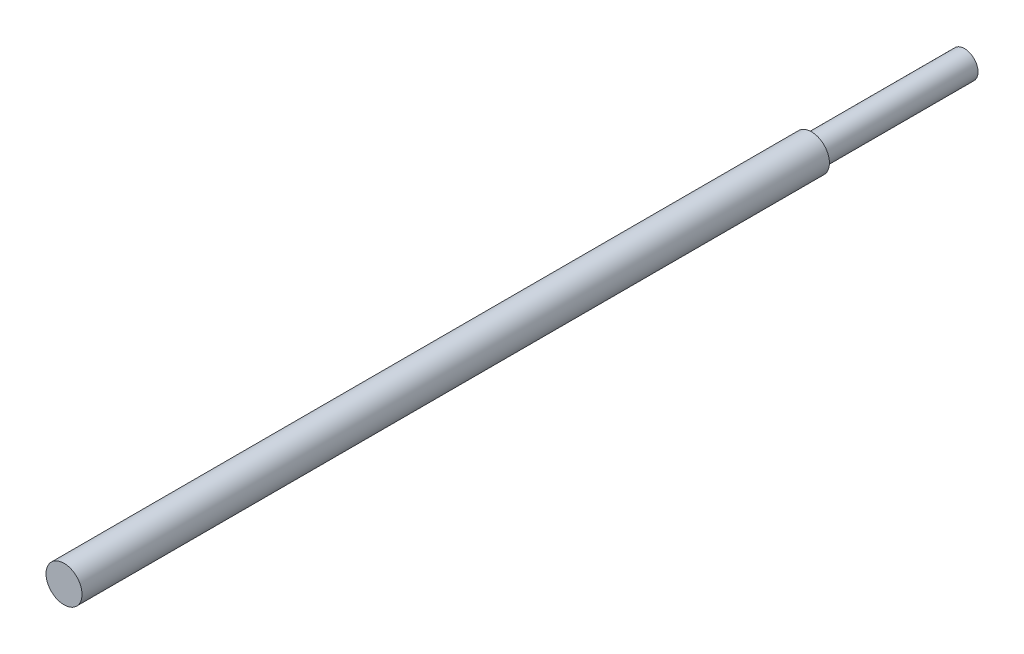
ISO-10303-21;
HEADER;
FILE_DESCRIPTION(('STEP AP214'),'2;1');
FILE_NAME('part.step','',(''),(''),'','','');
FILE_SCHEMA(('AUTOMOTIVE_DESIGN { 1 0 10303 214 1 1 1 1 }'));
ENDSEC;
DATA;
#1=APPLICATION_CONTEXT('core data for automotive mechanical design processes');
#2=APPLICATION_PROTOCOL_DEFINITION('international standard','automotive_design',2000,#1);
#3=PRODUCT_CONTEXT('',#1,'mechanical');
#4=PRODUCT('Part','Part','',(#3));
#5=PRODUCT_RELATED_PRODUCT_CATEGORY('part','',(#4));
#6=PRODUCT_DEFINITION_FORMATION('','',#4);
#7=PRODUCT_DEFINITION_CONTEXT('part definition',#1,'design');
#8=PRODUCT_DEFINITION('design','',#6,#7);
#9=PRODUCT_DEFINITION_SHAPE('','',#8);
#10=(LENGTH_UNIT() NAMED_UNIT(*) SI_UNIT(.MILLI.,.METRE.));
#11=(NAMED_UNIT(*) PLANE_ANGLE_UNIT() SI_UNIT($,.RADIAN.));
#12=(NAMED_UNIT(*) SI_UNIT($,.STERADIAN.) SOLID_ANGLE_UNIT());
#13=UNCERTAINTY_MEASURE_WITH_UNIT(LENGTH_MEASURE(1.E-05),#10,'distance_accuracy_value','');
#14=(GEOMETRIC_REPRESENTATION_CONTEXT(3) GLOBAL_UNCERTAINTY_ASSIGNED_CONTEXT((#13)) GLOBAL_UNIT_ASSIGNED_CONTEXT((#10,
#11,#12)) REPRESENTATION_CONTEXT('',''));
#15=CARTESIAN_POINT('',(0.,0.,0.));
#16=DIRECTION('',(0.,0.,1.));
#17=DIRECTION('',(1.,0.,0.));
#18=AXIS2_PLACEMENT_3D('',#15,#16,#17);
#19=CARTESIAN_POINT('',(0.,0.,400.));
#20=DIRECTION('',(0.,0.,-1.));
#21=DIRECTION('',(-1.,0.,0.));
#22=AXIS2_PLACEMENT_3D('',#19,#20,#21);
#23=CYLINDRICAL_SURFACE('',#22,8.);
#24=CARTESIAN_POINT('',(0.,0.,400.));
#25=DIRECTION('',(0.,0.,1.));
#26=DIRECTION('',(1.,0.,0.));
#27=AXIS2_PLACEMENT_3D('',#24,#25,#26);
#28=CIRCLE('',#27,8.);
#29=CARTESIAN_POINT('',(8.,0.,400.));
#30=VERTEX_POINT('',#29);
#31=EDGE_CURVE('E10',#30,#30,#28,.T.);
#32=ORIENTED_EDGE('',*,*,#31,.F.);
#33=EDGE_LOOP('',(#32));
#34=FACE_BOUND('',#33,.T.);
#35=CARTESIAN_POINT('',(0.,0.,68.));
#36=DIRECTION('',(0.,0.,-1.));
#37=DIRECTION('',(-1.,0.,0.));
#38=AXIS2_PLACEMENT_3D('',#35,#36,#37);
#39=CIRCLE('',#38,8.);
#40=CARTESIAN_POINT('',(-8.,0.,68.));
#41=VERTEX_POINT('',#40);
#42=EDGE_CURVE('E35',#41,#41,#39,.T.);
#43=ORIENTED_EDGE('',*,*,#42,.F.);
#44=EDGE_LOOP('',(#43));
#45=FACE_BOUND('',#44,.T.);
#46=ADVANCED_FACE('F32',(#34,#45),#23,.T.);
#47=CARTESIAN_POINT('',(0.,0.,400.));
#48=DIRECTION('',(0.,0.,1.));
#49=DIRECTION('',(1.,0.,0.));
#50=AXIS2_PLACEMENT_3D('',#47,#48,#49);
#51=PLANE('',#50);
#52=ORIENTED_EDGE('',*,*,#31,.T.);
#53=EDGE_LOOP('',(#52));
#54=FACE_BOUND('',#53,.T.);
#55=ADVANCED_FACE('F56',(#54),#51,.T.);
#56=CARTESIAN_POINT('',(0.,0.,68.));
#57=DIRECTION('',(0.,0.,-1.));
#58=DIRECTION('',(-1.,0.,0.));
#59=AXIS2_PLACEMENT_3D('',#56,#57,#58);
#60=PLANE('',#59);
#61=CARTESIAN_POINT('',(0.,0.,68.));
#62=DIRECTION('',(0.,0.,-1.));
#63=DIRECTION('',(-1.,0.,0.));
#64=AXIS2_PLACEMENT_3D('',#61,#62,#63);
#65=CIRCLE('',#64,6.);
#66=CARTESIAN_POINT('',(-6.,0.,68.));
#67=VERTEX_POINT('',#66);
#68=EDGE_CURVE('E42',#67,#67,#65,.T.);
#69=ORIENTED_EDGE('',*,*,#68,.F.);
#70=EDGE_LOOP('',(#69));
#71=FACE_BOUND('',#70,.T.);
#72=ORIENTED_EDGE('',*,*,#42,.T.);
#73=EDGE_LOOP('',(#72));
#74=FACE_BOUND('',#73,.T.);
#75=ADVANCED_FACE('F53',(#71,#74),#60,.T.);
#76=CARTESIAN_POINT('',(0.,0.,68.));
#77=DIRECTION('',(0.,0.,-1.));
#78=DIRECTION('',(-1.,0.,0.));
#79=AXIS2_PLACEMENT_3D('',#76,#77,#78);
#80=CYLINDRICAL_SURFACE('',#79,6.);
#81=ORIENTED_EDGE('',*,*,#68,.T.);
#82=EDGE_LOOP('',(#81));
#83=FACE_BOUND('',#82,.T.);
#84=CARTESIAN_POINT('',(0.,0.,0.));
#85=DIRECTION('',(0.,0.,-1.));
#86=DIRECTION('',(-1.,0.,0.));
#87=AXIS2_PLACEMENT_3D('',#84,#85,#86);
#88=CIRCLE('',#87,6.);
#89=CARTESIAN_POINT('',(-6.,0.,0.));
#90=VERTEX_POINT('',#89);
#91=EDGE_CURVE('E44',#90,#90,#88,.T.);
#92=ORIENTED_EDGE('',*,*,#91,.F.);
#93=EDGE_LOOP('',(#92));
#94=FACE_BOUND('',#93,.T.);
#95=ADVANCED_FACE('F50',(#83,#94),#80,.T.);
#96=CARTESIAN_POINT('',(0.,0.,0.));
#97=DIRECTION('',(0.,0.,1.));
#98=DIRECTION('',(1.,0.,0.));
#99=AXIS2_PLACEMENT_3D('',#96,#97,#98);
#100=PLANE('',#99);
#101=ORIENTED_EDGE('',*,*,#91,.T.);
#102=EDGE_LOOP('',(#101));
#103=FACE_BOUND('',#102,.T.);
#104=ADVANCED_FACE('F69',(#103),#100,.F.);
#105=CLOSED_SHELL('',(#46,#55,#75,#95,#104));
#106=MANIFOLD_SOLID_BREP('B2',#105);
#107=ADVANCED_BREP_SHAPE_REPRESENTATION('',(#18,#106),#14);
#108=SHAPE_DEFINITION_REPRESENTATION(#9,#107);
ENDSEC;
END-ISO-10303-21;
